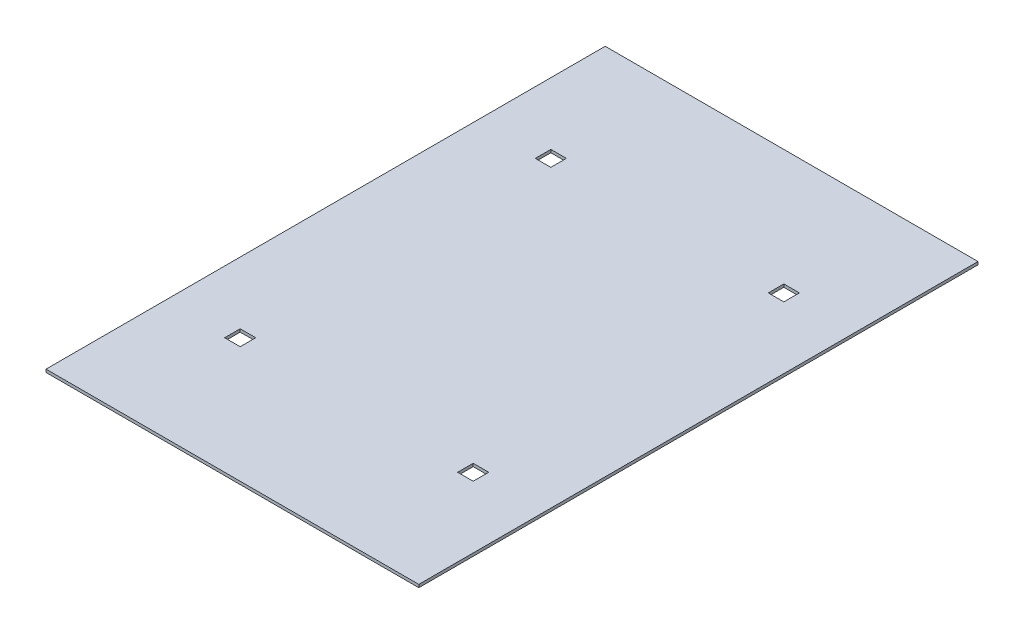
ISO-10303-21;
HEADER;
FILE_DESCRIPTION(('STEP AP214'),'2;1');
FILE_NAME('part.step','',(''),(''),'','','');
FILE_SCHEMA(('AUTOMOTIVE_DESIGN { 1 0 10303 214 1 1 1 1 }'));
ENDSEC;
DATA;
#1=APPLICATION_CONTEXT('core data for automotive mechanical design processes');
#2=APPLICATION_PROTOCOL_DEFINITION('international standard','automotive_design',2000,#1);
#3=PRODUCT_CONTEXT('',#1,'mechanical');
#4=PRODUCT('Part','Part','',(#3));
#5=PRODUCT_RELATED_PRODUCT_CATEGORY('part','',(#4));
#6=PRODUCT_DEFINITION_FORMATION('','',#4);
#7=PRODUCT_DEFINITION_CONTEXT('part definition',#1,'design');
#8=PRODUCT_DEFINITION('design','',#6,#7);
#9=PRODUCT_DEFINITION_SHAPE('','',#8);
#10=(LENGTH_UNIT() NAMED_UNIT(*) SI_UNIT(.MILLI.,.METRE.));
#11=(NAMED_UNIT(*) PLANE_ANGLE_UNIT() SI_UNIT($,.RADIAN.));
#12=(NAMED_UNIT(*) SI_UNIT($,.STERADIAN.) SOLID_ANGLE_UNIT());
#13=UNCERTAINTY_MEASURE_WITH_UNIT(LENGTH_MEASURE(1.E-05),#10,'distance_accuracy_value','');
#14=(GEOMETRIC_REPRESENTATION_CONTEXT(3) GLOBAL_UNCERTAINTY_ASSIGNED_CONTEXT((#13)) GLOBAL_UNIT_ASSIGNED_CONTEXT((#10,
#11,#12)) REPRESENTATION_CONTEXT('',''));
#15=CARTESIAN_POINT('',(0.,0.,0.));
#16=DIRECTION('',(0.,0.,1.));
#17=DIRECTION('',(1.,0.,0.));
#18=AXIS2_PLACEMENT_3D('',#15,#16,#17);
#19=CARTESIAN_POINT('',(0.,4.7625,0.));
#20=DIRECTION('',(1.,0.,0.));
#21=DIRECTION('',(0.,0.,-1.));
#22=AXIS2_PLACEMENT_3D('',#19,#20,#21);
#23=PLANE('',#22);
#24=DIRECTION('',(0.,0.,1.));
#25=VECTOR('',#24,1.);
#26=CARTESIAN_POINT('',(0.,0.,0.));
#27=LINE('',#26,#25);
#28=CARTESIAN_POINT('',(0.,0.,-914.4));
#29=VERTEX_POINT('',#28);
#30=CARTESIAN_POINT('',(0.,0.,0.));
#31=VERTEX_POINT('',#30);
#32=EDGE_CURVE('E298',#29,#31,#27,.T.);
#33=ORIENTED_EDGE('',*,*,#32,.T.);
#34=DIRECTION('',(0.,-1.,0.));
#35=VECTOR('',#34,1.);
#36=CARTESIAN_POINT('',(0.,4.7625,0.));
#37=LINE('',#36,#35);
#38=CARTESIAN_POINT('',(0.,4.7625,0.));
#39=VERTEX_POINT('',#38);
#40=EDGE_CURVE('E11',#39,#31,#37,.T.);
#41=ORIENTED_EDGE('',*,*,#40,.F.);
#42=DIRECTION('',(0.,0.,1.));
#43=VECTOR('',#42,1.);
#44=CARTESIAN_POINT('',(0.,4.7625,0.));
#45=LINE('',#44,#43);
#46=CARTESIAN_POINT('',(0.,4.7625,-914.4));
#47=VERTEX_POINT('',#46);
#48=EDGE_CURVE('E305',#47,#39,#45,.T.);
#49=ORIENTED_EDGE('',*,*,#48,.F.);
#50=DIRECTION('',(0.,-1.,0.));
#51=VECTOR('',#50,1.);
#52=CARTESIAN_POINT('',(0.,4.7625,-914.4));
#53=LINE('',#52,#51);
#54=EDGE_CURVE('E315',#47,#29,#53,.T.);
#55=ORIENTED_EDGE('',*,*,#54,.T.);
#56=EDGE_LOOP('',(#33,#41,#49,#55));
#57=FACE_BOUND('',#56,.T.);
#58=ADVANCED_FACE('F33',(#57),#23,.F.);
#59=CARTESIAN_POINT('',(0.,4.7625,0.));
#60=DIRECTION('',(0.,0.,-1.));
#61=DIRECTION('',(-1.,0.,0.));
#62=AXIS2_PLACEMENT_3D('',#59,#60,#61);
#63=PLANE('',#62);
#64=DIRECTION('',(1.,0.,0.));
#65=VECTOR('',#64,1.);
#66=CARTESIAN_POINT('',(0.,0.,0.));
#67=LINE('',#66,#65);
#68=CARTESIAN_POINT('',(609.6,0.,0.));
#69=VERTEX_POINT('',#68);
#70=EDGE_CURVE('E318',#31,#69,#67,.T.);
#71=ORIENTED_EDGE('',*,*,#70,.T.);
#72=DIRECTION('',(0.,-1.,0.));
#73=VECTOR('',#72,1.);
#74=CARTESIAN_POINT('',(609.6,4.7625,0.));
#75=LINE('',#74,#73);
#76=CARTESIAN_POINT('',(609.6,4.7625,0.));
#77=VERTEX_POINT('',#76);
#78=EDGE_CURVE('E40',#77,#69,#75,.T.);
#79=ORIENTED_EDGE('',*,*,#78,.F.);
#80=DIRECTION('',(1.,0.,0.));
#81=VECTOR('',#80,1.);
#82=CARTESIAN_POINT('',(0.,4.7625,0.));
#83=LINE('',#82,#81);
#84=EDGE_CURVE('E308',#39,#77,#83,.T.);
#85=ORIENTED_EDGE('',*,*,#84,.F.);
#86=ORIENTED_EDGE('',*,*,#40,.T.);
#87=EDGE_LOOP('',(#71,#79,#85,#86));
#88=FACE_BOUND('',#87,.T.);
#89=ADVANCED_FACE('F347',(#88),#63,.F.);
#90=CARTESIAN_POINT('',(609.6,4.7625,0.));
#91=DIRECTION('',(-1.,0.,0.));
#92=DIRECTION('',(0.,0.,1.));
#93=AXIS2_PLACEMENT_3D('',#90,#91,#92);
#94=PLANE('',#93);
#95=DIRECTION('',(0.,0.,-1.));
#96=VECTOR('',#95,1.);
#97=CARTESIAN_POINT('',(609.6,0.,0.));
#98=LINE('',#97,#96);
#99=CARTESIAN_POINT('',(609.6,0.,-914.4));
#100=VERTEX_POINT('',#99);
#101=EDGE_CURVE('E320',#69,#100,#98,.T.);
#102=ORIENTED_EDGE('',*,*,#101,.T.);
#103=DIRECTION('',(0.,-1.,0.));
#104=VECTOR('',#103,1.);
#105=CARTESIAN_POINT('',(609.6,4.7625,-914.4));
#106=LINE('',#105,#104);
#107=CARTESIAN_POINT('',(609.6,4.7625,-914.4));
#108=VERTEX_POINT('',#107);
#109=EDGE_CURVE('E325',#108,#100,#106,.T.);
#110=ORIENTED_EDGE('',*,*,#109,.F.);
#111=DIRECTION('',(0.,0.,-1.));
#112=VECTOR('',#111,1.);
#113=CARTESIAN_POINT('',(609.6,4.7625,0.));
#114=LINE('',#113,#112);
#115=EDGE_CURVE('E311',#77,#108,#114,.T.);
#116=ORIENTED_EDGE('',*,*,#115,.F.);
#117=ORIENTED_EDGE('',*,*,#78,.T.);
#118=EDGE_LOOP('',(#102,#110,#116,#117));
#119=FACE_BOUND('',#118,.T.);
#120=ADVANCED_FACE('F332',(#119),#94,.F.);
#121=CARTESIAN_POINT('',(0.,4.7625,-914.4));
#122=DIRECTION('',(0.,0.,1.));
#123=DIRECTION('',(1.,0.,0.));
#124=AXIS2_PLACEMENT_3D('',#121,#122,#123);
#125=PLANE('',#124);
#126=DIRECTION('',(-1.,0.,0.));
#127=VECTOR('',#126,1.);
#128=CARTESIAN_POINT('',(0.,0.,-914.4));
#129=LINE('',#128,#127);
#130=EDGE_CURVE('E309',#100,#29,#129,.T.);
#131=ORIENTED_EDGE('',*,*,#130,.T.);
#132=ORIENTED_EDGE('',*,*,#54,.F.);
#133=DIRECTION('',(-1.,0.,0.));
#134=VECTOR('',#133,1.);
#135=CARTESIAN_POINT('',(0.,4.7625,-914.4));
#136=LINE('',#135,#134);
#137=EDGE_CURVE('E313',#108,#47,#136,.T.);
#138=ORIENTED_EDGE('',*,*,#137,.F.);
#139=ORIENTED_EDGE('',*,*,#109,.T.);
#140=EDGE_LOOP('',(#131,#132,#138,#139));
#141=FACE_BOUND('',#140,.T.);
#142=ADVANCED_FACE('F340',(#141),#125,.F.);
#143=CARTESIAN_POINT('',(0.,4.7625,0.));
#144=DIRECTION('',(0.,-1.,0.));
#145=DIRECTION('',(0.,0.,-1.));
#146=AXIS2_PLACEMENT_3D('',#143,#144,#145);
#147=PLANE('',#146);
#148=DIRECTION('',(1.,0.,0.));
#149=VECTOR('',#148,1.);
#150=CARTESIAN_POINT('',(482.6,4.7625,-698.5));
#151=LINE('',#150,#149);
#152=CARTESIAN_POINT('',(482.6,4.7625,-698.5));
#153=VERTEX_POINT('',#152);
#154=CARTESIAN_POINT('',(508.,4.7625,-698.5));
#155=VERTEX_POINT('',#154);
#156=EDGE_CURVE('E227',#153,#155,#151,.T.);
#157=ORIENTED_EDGE('',*,*,#156,.F.);
#158=DIRECTION('',(0.,0.,1.));
#159=VECTOR('',#158,1.);
#160=CARTESIAN_POINT('',(482.6,4.7625,-723.9));
#161=LINE('',#160,#159);
#162=CARTESIAN_POINT('',(482.6,4.7625,-723.9));
#163=VERTEX_POINT('',#162);
#164=EDGE_CURVE('E47',#163,#153,#161,.T.);
#165=ORIENTED_EDGE('',*,*,#164,.F.);
#166=DIRECTION('',(-1.,0.,0.));
#167=VECTOR('',#166,1.);
#168=CARTESIAN_POINT('',(482.6,4.7625,-723.9));
#169=LINE('',#168,#167);
#170=CARTESIAN_POINT('',(508.,4.7625,-723.9));
#171=VERTEX_POINT('',#170);
#172=EDGE_CURVE('E216',#171,#163,#169,.T.);
#173=ORIENTED_EDGE('',*,*,#172,.F.);
#174=DIRECTION('',(0.,0.,-1.));
#175=VECTOR('',#174,1.);
#176=CARTESIAN_POINT('',(508.,4.7625,-723.9));
#177=LINE('',#176,#175);
#178=EDGE_CURVE('E231',#155,#171,#177,.T.);
#179=ORIENTED_EDGE('',*,*,#178,.F.);
#180=EDGE_LOOP('',(#157,#165,#173,#179));
#181=FACE_BOUND('',#180,.T.);
#182=DIRECTION('',(1.,0.,0.));
#183=VECTOR('',#182,1.);
#184=CARTESIAN_POINT('',(101.6,4.7625,-190.5));
#185=LINE('',#184,#183);
#186=CARTESIAN_POINT('',(101.6,4.7625,-190.5));
#187=VERTEX_POINT('',#186);
#188=CARTESIAN_POINT('',(127.,4.7625,-190.5));
#189=VERTEX_POINT('',#188);
#190=EDGE_CURVE('E259',#187,#189,#185,.T.);
#191=ORIENTED_EDGE('',*,*,#190,.F.);
#192=DIRECTION('',(0.,0.,1.));
#193=VECTOR('',#192,1.);
#194=CARTESIAN_POINT('',(101.6,4.7625,-215.9));
#195=LINE('',#194,#193);
#196=CARTESIAN_POINT('',(101.6,4.7625,-215.9));
#197=VERTEX_POINT('',#196);
#198=EDGE_CURVE('E55',#197,#187,#195,.T.);
#199=ORIENTED_EDGE('',*,*,#198,.F.);
#200=DIRECTION('',(-1.,0.,0.));
#201=VECTOR('',#200,1.);
#202=CARTESIAN_POINT('',(101.6,4.7625,-215.9));
#203=LINE('',#202,#201);
#204=CARTESIAN_POINT('',(127.,4.7625,-215.9));
#205=VERTEX_POINT('',#204);
#206=EDGE_CURVE('E248',#205,#197,#203,.T.);
#207=ORIENTED_EDGE('',*,*,#206,.F.);
#208=DIRECTION('',(0.,0.,-1.));
#209=VECTOR('',#208,1.);
#210=CARTESIAN_POINT('',(127.,4.7625,-215.9));
#211=LINE('',#210,#209);
#212=EDGE_CURVE('E262',#189,#205,#211,.T.);
#213=ORIENTED_EDGE('',*,*,#212,.F.);
#214=EDGE_LOOP('',(#191,#199,#207,#213));
#215=FACE_BOUND('',#214,.T.);
#216=DIRECTION('',(-1.,0.,0.));
#217=VECTOR('',#216,1.);
#218=CARTESIAN_POINT('',(508.,4.7625,-215.9));
#219=LINE('',#218,#217);
#220=CARTESIAN_POINT('',(508.,4.7625,-215.9));
#221=VERTEX_POINT('',#220);
#222=CARTESIAN_POINT('',(482.6,4.7625,-215.9));
#223=VERTEX_POINT('',#222);
#224=EDGE_CURVE('E203',#221,#223,#219,.T.);
#225=ORIENTED_EDGE('',*,*,#224,.F.);
#226=DIRECTION('',(0.,0.,-1.));
#227=VECTOR('',#226,1.);
#228=CARTESIAN_POINT('',(508.,4.7625,-190.5));
#229=LINE('',#228,#227);
#230=CARTESIAN_POINT('',(508.,4.7625,-190.5));
#231=VERTEX_POINT('',#230);
#232=EDGE_CURVE('E176',#231,#221,#229,.T.);
#233=ORIENTED_EDGE('',*,*,#232,.F.);
#234=DIRECTION('',(1.,0.,0.));
#235=VECTOR('',#234,1.);
#236=CARTESIAN_POINT('',(508.,4.7625,-190.5));
#237=LINE('',#236,#235);
#238=CARTESIAN_POINT('',(482.6,4.7625,-190.5));
#239=VERTEX_POINT('',#238);
#240=EDGE_CURVE('E194',#239,#231,#237,.T.);
#241=ORIENTED_EDGE('',*,*,#240,.F.);
#242=DIRECTION('',(0.,0.,1.));
#243=VECTOR('',#242,1.);
#244=CARTESIAN_POINT('',(482.6,4.7625,-190.5));
#245=LINE('',#244,#243);
#246=EDGE_CURVE('E197',#223,#239,#245,.T.);
#247=ORIENTED_EDGE('',*,*,#246,.F.);
#248=EDGE_LOOP('',(#225,#233,#241,#247));
#249=FACE_BOUND('',#248,.T.);
#250=DIRECTION('',(1.,0.,0.));
#251=VECTOR('',#250,1.);
#252=CARTESIAN_POINT('',(101.6,4.7625,-698.5));
#253=LINE('',#252,#251);
#254=CARTESIAN_POINT('',(101.6,4.7625,-698.5));
#255=VERTEX_POINT('',#254);
#256=CARTESIAN_POINT('',(127.,4.7625,-698.5));
#257=VERTEX_POINT('',#256);
#258=EDGE_CURVE('E288',#255,#257,#253,.T.);
#259=ORIENTED_EDGE('',*,*,#258,.F.);
#260=DIRECTION('',(0.,0.,1.));
#261=VECTOR('',#260,1.);
#262=CARTESIAN_POINT('',(101.6,4.7625,-723.9));
#263=LINE('',#262,#261);
#264=CARTESIAN_POINT('',(101.6,4.7625,-723.9));
#265=VERTEX_POINT('',#264);
#266=EDGE_CURVE('E238',#265,#255,#263,.T.);
#267=ORIENTED_EDGE('',*,*,#266,.F.);
#268=DIRECTION('',(-1.,0.,0.));
#269=VECTOR('',#268,1.);
#270=CARTESIAN_POINT('',(101.6,4.7625,-723.9));
#271=LINE('',#270,#269);
#272=CARTESIAN_POINT('',(127.,4.7625,-723.9));
#273=VERTEX_POINT('',#272);
#274=EDGE_CURVE('E277',#273,#265,#271,.T.);
#275=ORIENTED_EDGE('',*,*,#274,.F.);
#276=DIRECTION('',(0.,0.,-1.));
#277=VECTOR('',#276,1.);
#278=CARTESIAN_POINT('',(127.,4.7625,-723.9));
#279=LINE('',#278,#277);
#280=EDGE_CURVE('E291',#257,#273,#279,.T.);
#281=ORIENTED_EDGE('',*,*,#280,.F.);
#282=EDGE_LOOP('',(#259,#267,#275,#281));
#283=FACE_BOUND('',#282,.T.);
#284=ORIENTED_EDGE('',*,*,#48,.T.);
#285=ORIENTED_EDGE('',*,*,#84,.T.);
#286=ORIENTED_EDGE('',*,*,#115,.T.);
#287=ORIENTED_EDGE('',*,*,#137,.T.);
#288=EDGE_LOOP('',(#284,#285,#286,#287));
#289=FACE_BOUND('',#288,.T.);
#290=ADVANCED_FACE('F346',(#181,#215,#249,#283,#289),#147,.F.);
#291=CARTESIAN_POINT('',(0.,0.,0.));
#292=DIRECTION('',(0.,-1.,0.));
#293=DIRECTION('',(0.,0.,-1.));
#294=AXIS2_PLACEMENT_3D('',#291,#292,#293);
#295=PLANE('',#294);
#296=DIRECTION('',(0.,0.,1.));
#297=VECTOR('',#296,1.);
#298=CARTESIAN_POINT('',(482.6,0.,-723.9));
#299=LINE('',#298,#297);
#300=CARTESIAN_POINT('',(482.6,0.,-723.9));
#301=VERTEX_POINT('',#300);
#302=CARTESIAN_POINT('',(482.6,0.,-698.5));
#303=VERTEX_POINT('',#302);
#304=EDGE_CURVE('E212',#301,#303,#299,.T.);
#305=ORIENTED_EDGE('',*,*,#304,.T.);
#306=DIRECTION('',(1.,0.,0.));
#307=VECTOR('',#306,1.);
#308=CARTESIAN_POINT('',(482.6,0.,-698.5));
#309=LINE('',#308,#307);
#310=CARTESIAN_POINT('',(508.,0.,-698.5));
#311=VERTEX_POINT('',#310);
#312=EDGE_CURVE('E215',#303,#311,#309,.T.);
#313=ORIENTED_EDGE('',*,*,#312,.T.);
#314=DIRECTION('',(0.,0.,-1.));
#315=VECTOR('',#314,1.);
#316=CARTESIAN_POINT('',(508.,0.,-723.9));
#317=LINE('',#316,#315);
#318=CARTESIAN_POINT('',(508.,0.,-723.9));
#319=VERTEX_POINT('',#318);
#320=EDGE_CURVE('E219',#311,#319,#317,.T.);
#321=ORIENTED_EDGE('',*,*,#320,.T.);
#322=DIRECTION('',(-1.,0.,0.));
#323=VECTOR('',#322,1.);
#324=CARTESIAN_POINT('',(482.6,0.,-723.9));
#325=LINE('',#324,#323);
#326=EDGE_CURVE('E222',#319,#301,#325,.T.);
#327=ORIENTED_EDGE('',*,*,#326,.T.);
#328=EDGE_LOOP('',(#305,#313,#321,#327));
#329=FACE_BOUND('',#328,.T.);
#330=DIRECTION('',(0.,0.,1.));
#331=VECTOR('',#330,1.);
#332=CARTESIAN_POINT('',(101.6,0.,-215.9));
#333=LINE('',#332,#331);
#334=CARTESIAN_POINT('',(101.6,0.,-215.9));
#335=VERTEX_POINT('',#334);
#336=CARTESIAN_POINT('',(101.6,0.,-190.5));
#337=VERTEX_POINT('',#336);
#338=EDGE_CURVE('E244',#335,#337,#333,.T.);
#339=ORIENTED_EDGE('',*,*,#338,.T.);
#340=DIRECTION('',(1.,0.,0.));
#341=VECTOR('',#340,1.);
#342=CARTESIAN_POINT('',(101.6,0.,-190.5));
#343=LINE('',#342,#341);
#344=CARTESIAN_POINT('',(127.,0.,-190.5));
#345=VERTEX_POINT('',#344);
#346=EDGE_CURVE('E247',#337,#345,#343,.T.);
#347=ORIENTED_EDGE('',*,*,#346,.T.);
#348=DIRECTION('',(0.,0.,-1.));
#349=VECTOR('',#348,1.);
#350=CARTESIAN_POINT('',(127.,0.,-215.9));
#351=LINE('',#350,#349);
#352=CARTESIAN_POINT('',(127.,0.,-215.9));
#353=VERTEX_POINT('',#352);
#354=EDGE_CURVE('E251',#345,#353,#351,.T.);
#355=ORIENTED_EDGE('',*,*,#354,.T.);
#356=DIRECTION('',(-1.,0.,0.));
#357=VECTOR('',#356,1.);
#358=CARTESIAN_POINT('',(101.6,0.,-215.9));
#359=LINE('',#358,#357);
#360=EDGE_CURVE('E254',#353,#335,#359,.T.);
#361=ORIENTED_EDGE('',*,*,#360,.T.);
#362=EDGE_LOOP('',(#339,#347,#355,#361));
#363=FACE_BOUND('',#362,.T.);
#364=DIRECTION('',(0.,0.,-1.));
#365=VECTOR('',#364,1.);
#366=CARTESIAN_POINT('',(508.,0.,-190.5));
#367=LINE('',#366,#365);
#368=CARTESIAN_POINT('',(508.,0.,-190.5));
#369=VERTEX_POINT('',#368);
#370=CARTESIAN_POINT('',(508.,0.,-215.9));
#371=VERTEX_POINT('',#370);
#372=EDGE_CURVE('E173',#369,#371,#367,.T.);
#373=ORIENTED_EDGE('',*,*,#372,.T.);
#374=DIRECTION('',(-1.,0.,0.));
#375=VECTOR('',#374,1.);
#376=CARTESIAN_POINT('',(508.,0.,-215.9));
#377=LINE('',#376,#375);
#378=CARTESIAN_POINT('',(482.6,0.,-215.9));
#379=VERTEX_POINT('',#378);
#380=EDGE_CURVE('E185',#371,#379,#377,.T.);
#381=ORIENTED_EDGE('',*,*,#380,.T.);
#382=DIRECTION('',(0.,0.,1.));
#383=VECTOR('',#382,1.);
#384=CARTESIAN_POINT('',(482.6,0.,-190.5));
#385=LINE('',#384,#383);
#386=CARTESIAN_POINT('',(482.6,0.,-190.5));
#387=VERTEX_POINT('',#386);
#388=EDGE_CURVE('E189',#379,#387,#385,.T.);
#389=ORIENTED_EDGE('',*,*,#388,.T.);
#390=DIRECTION('',(1.,0.,0.));
#391=VECTOR('',#390,1.);
#392=CARTESIAN_POINT('',(508.,0.,-190.5));
#393=LINE('',#392,#391);
#394=EDGE_CURVE('E181',#387,#369,#393,.T.);
#395=ORIENTED_EDGE('',*,*,#394,.T.);
#396=EDGE_LOOP('',(#373,#381,#389,#395));
#397=FACE_BOUND('',#396,.T.);
#398=DIRECTION('',(0.,0.,1.));
#399=VECTOR('',#398,1.);
#400=CARTESIAN_POINT('',(101.6,0.,-723.9));
#401=LINE('',#400,#399);
#402=CARTESIAN_POINT('',(101.6,0.,-723.9));
#403=VERTEX_POINT('',#402);
#404=CARTESIAN_POINT('',(101.6,0.,-698.5));
#405=VERTEX_POINT('',#404);
#406=EDGE_CURVE('E273',#403,#405,#401,.T.);
#407=ORIENTED_EDGE('',*,*,#406,.T.);
#408=DIRECTION('',(1.,0.,0.));
#409=VECTOR('',#408,1.);
#410=CARTESIAN_POINT('',(101.6,0.,-698.5));
#411=LINE('',#410,#409);
#412=CARTESIAN_POINT('',(127.,0.,-698.5));
#413=VERTEX_POINT('',#412);
#414=EDGE_CURVE('E276',#405,#413,#411,.T.);
#415=ORIENTED_EDGE('',*,*,#414,.T.);
#416=DIRECTION('',(0.,0.,-1.));
#417=VECTOR('',#416,1.);
#418=CARTESIAN_POINT('',(127.,0.,-723.9));
#419=LINE('',#418,#417);
#420=CARTESIAN_POINT('',(127.,0.,-723.9));
#421=VERTEX_POINT('',#420);
#422=EDGE_CURVE('E280',#413,#421,#419,.T.);
#423=ORIENTED_EDGE('',*,*,#422,.T.);
#424=DIRECTION('',(-1.,0.,0.));
#425=VECTOR('',#424,1.);
#426=CARTESIAN_POINT('',(101.6,0.,-723.9));
#427=LINE('',#426,#425);
#428=EDGE_CURVE('E283',#421,#403,#427,.T.);
#429=ORIENTED_EDGE('',*,*,#428,.T.);
#430=EDGE_LOOP('',(#407,#415,#423,#429));
#431=FACE_BOUND('',#430,.T.);
#432=ORIENTED_EDGE('',*,*,#32,.F.);
#433=ORIENTED_EDGE('',*,*,#130,.F.);
#434=ORIENTED_EDGE('',*,*,#101,.F.);
#435=ORIENTED_EDGE('',*,*,#70,.F.);
#436=EDGE_LOOP('',(#432,#433,#434,#435));
#437=FACE_BOUND('',#436,.T.);
#438=ADVANCED_FACE('F191',(#329,#363,#397,#431,#437),#295,.T.);
#439=CARTESIAN_POINT('',(101.6,0.,-723.9));
#440=DIRECTION('',(-1.,0.,0.));
#441=DIRECTION('',(0.,0.,1.));
#442=AXIS2_PLACEMENT_3D('',#439,#440,#441);
#443=PLANE('',#442);
#444=ORIENTED_EDGE('',*,*,#266,.T.);
#445=DIRECTION('',(0.,1.,0.));
#446=VECTOR('',#445,1.);
#447=CARTESIAN_POINT('',(101.6,0.,-698.5));
#448=LINE('',#447,#446);
#449=EDGE_CURVE('E286',#405,#255,#448,.T.);
#450=ORIENTED_EDGE('',*,*,#449,.F.);
#451=ORIENTED_EDGE('',*,*,#406,.F.);
#452=DIRECTION('',(0.,1.,0.));
#453=VECTOR('',#452,1.);
#454=CARTESIAN_POINT('',(101.6,0.,-723.9));
#455=LINE('',#454,#453);
#456=EDGE_CURVE('E296',#403,#265,#455,.T.);
#457=ORIENTED_EDGE('',*,*,#456,.T.);
#458=EDGE_LOOP('',(#444,#450,#451,#457));
#459=FACE_BOUND('',#458,.T.);
#460=ADVANCED_FACE('F359',(#459),#443,.F.);
#461=CARTESIAN_POINT('',(101.6,0.,-723.9));
#462=DIRECTION('',(0.,0.,-1.));
#463=DIRECTION('',(-1.,0.,0.));
#464=AXIS2_PLACEMENT_3D('',#461,#462,#463);
#465=PLANE('',#464);
#466=ORIENTED_EDGE('',*,*,#274,.T.);
#467=ORIENTED_EDGE('',*,*,#456,.F.);
#468=ORIENTED_EDGE('',*,*,#428,.F.);
#469=DIRECTION('',(0.,1.,0.));
#470=VECTOR('',#469,1.);
#471=CARTESIAN_POINT('',(127.,0.,-723.9));
#472=LINE('',#471,#470);
#473=EDGE_CURVE('E299',#421,#273,#472,.T.);
#474=ORIENTED_EDGE('',*,*,#473,.T.);
#475=EDGE_LOOP('',(#466,#467,#468,#474));
#476=FACE_BOUND('',#475,.T.);
#477=ADVANCED_FACE('F366',(#476),#465,.F.);
#478=CARTESIAN_POINT('',(127.,0.,-723.9));
#479=DIRECTION('',(1.,0.,0.));
#480=DIRECTION('',(0.,0.,-1.));
#481=AXIS2_PLACEMENT_3D('',#478,#479,#480);
#482=PLANE('',#481);
#483=ORIENTED_EDGE('',*,*,#280,.T.);
#484=ORIENTED_EDGE('',*,*,#473,.F.);
#485=ORIENTED_EDGE('',*,*,#422,.F.);
#486=DIRECTION('',(0.,1.,0.));
#487=VECTOR('',#486,1.);
#488=CARTESIAN_POINT('',(127.,0.,-698.5));
#489=LINE('',#488,#487);
#490=EDGE_CURVE('E301',#413,#257,#489,.T.);
#491=ORIENTED_EDGE('',*,*,#490,.T.);
#492=EDGE_LOOP('',(#483,#484,#485,#491));
#493=FACE_BOUND('',#492,.T.);
#494=ADVANCED_FACE('F371',(#493),#482,.F.);
#495=CARTESIAN_POINT('',(101.6,0.,-698.5));
#496=DIRECTION('',(0.,0.,1.));
#497=DIRECTION('',(1.,0.,0.));
#498=AXIS2_PLACEMENT_3D('',#495,#496,#497);
#499=PLANE('',#498);
#500=ORIENTED_EDGE('',*,*,#258,.T.);
#501=ORIENTED_EDGE('',*,*,#490,.F.);
#502=ORIENTED_EDGE('',*,*,#414,.F.);
#503=ORIENTED_EDGE('',*,*,#449,.T.);
#504=EDGE_LOOP('',(#500,#501,#502,#503));
#505=FACE_BOUND('',#504,.T.);
#506=ADVANCED_FACE('F368',(#505),#499,.F.);
#507=CARTESIAN_POINT('',(508.,0.,-190.5));
#508=DIRECTION('',(1.,0.,0.));
#509=DIRECTION('',(0.,0.,-1.));
#510=AXIS2_PLACEMENT_3D('',#507,#508,#509);
#511=PLANE('',#510);
#512=ORIENTED_EDGE('',*,*,#232,.T.);
#513=DIRECTION('',(0.,1.,0.));
#514=VECTOR('',#513,1.);
#515=CARTESIAN_POINT('',(508.,0.,-215.9));
#516=LINE('',#515,#514);
#517=EDGE_CURVE('E169',#371,#221,#516,.T.);
#518=ORIENTED_EDGE('',*,*,#517,.F.);
#519=ORIENTED_EDGE('',*,*,#372,.F.);
#520=DIRECTION('',(0.,1.,0.));
#521=VECTOR('',#520,1.);
#522=CARTESIAN_POINT('',(508.,0.,-190.5));
#523=LINE('',#522,#521);
#524=EDGE_CURVE('E207',#369,#231,#523,.T.);
#525=ORIENTED_EDGE('',*,*,#524,.T.);
#526=EDGE_LOOP('',(#512,#518,#519,#525));
#527=FACE_BOUND('',#526,.T.);
#528=ADVANCED_FACE('F171',(#527),#511,.F.);
#529=CARTESIAN_POINT('',(508.,0.,-190.5));
#530=DIRECTION('',(0.,0.,1.));
#531=DIRECTION('',(1.,0.,0.));
#532=AXIS2_PLACEMENT_3D('',#529,#530,#531);
#533=PLANE('',#532);
#534=ORIENTED_EDGE('',*,*,#240,.T.);
#535=ORIENTED_EDGE('',*,*,#524,.F.);
#536=ORIENTED_EDGE('',*,*,#394,.F.);
#537=DIRECTION('',(0.,1.,0.));
#538=VECTOR('',#537,1.);
#539=CARTESIAN_POINT('',(482.6,0.,-190.5));
#540=LINE('',#539,#538);
#541=EDGE_CURVE('E209',#387,#239,#540,.T.);
#542=ORIENTED_EDGE('',*,*,#541,.T.);
#543=EDGE_LOOP('',(#534,#535,#536,#542));
#544=FACE_BOUND('',#543,.T.);
#545=ADVANCED_FACE('F411',(#544),#533,.F.);
#546=CARTESIAN_POINT('',(482.6,0.,-190.5));
#547=DIRECTION('',(-1.,0.,0.));
#548=DIRECTION('',(0.,0.,1.));
#549=AXIS2_PLACEMENT_3D('',#546,#547,#548);
#550=PLANE('',#549);
#551=ORIENTED_EDGE('',*,*,#246,.T.);
#552=ORIENTED_EDGE('',*,*,#541,.F.);
#553=ORIENTED_EDGE('',*,*,#388,.F.);
#554=DIRECTION('',(0.,1.,0.));
#555=VECTOR('',#554,1.);
#556=CARTESIAN_POINT('',(482.6,0.,-215.9));
#557=LINE('',#556,#555);
#558=EDGE_CURVE('E180',#379,#223,#557,.T.);
#559=ORIENTED_EDGE('',*,*,#558,.T.);
#560=EDGE_LOOP('',(#551,#552,#553,#559));
#561=FACE_BOUND('',#560,.T.);
#562=ADVANCED_FACE('F414',(#561),#550,.F.);
#563=CARTESIAN_POINT('',(508.,0.,-215.9));
#564=DIRECTION('',(0.,0.,-1.));
#565=DIRECTION('',(-1.,0.,0.));
#566=AXIS2_PLACEMENT_3D('',#563,#564,#565);
#567=PLANE('',#566);
#568=ORIENTED_EDGE('',*,*,#224,.T.);
#569=ORIENTED_EDGE('',*,*,#558,.F.);
#570=ORIENTED_EDGE('',*,*,#380,.F.);
#571=ORIENTED_EDGE('',*,*,#517,.T.);
#572=EDGE_LOOP('',(#568,#569,#570,#571));
#573=FACE_BOUND('',#572,.T.);
#574=ADVANCED_FACE('F186',(#573),#567,.F.);
#575=CARTESIAN_POINT('',(101.6,0.,-215.9));
#576=DIRECTION('',(-1.,0.,0.));
#577=DIRECTION('',(0.,0.,1.));
#578=AXIS2_PLACEMENT_3D('',#575,#576,#577);
#579=PLANE('',#578);
#580=ORIENTED_EDGE('',*,*,#198,.T.);
#581=DIRECTION('',(0.,1.,0.));
#582=VECTOR('',#581,1.);
#583=CARTESIAN_POINT('',(101.6,0.,-190.5));
#584=LINE('',#583,#582);
#585=EDGE_CURVE('E257',#337,#187,#584,.T.);
#586=ORIENTED_EDGE('',*,*,#585,.F.);
#587=ORIENTED_EDGE('',*,*,#338,.F.);
#588=DIRECTION('',(0.,1.,0.));
#589=VECTOR('',#588,1.);
#590=CARTESIAN_POINT('',(101.6,0.,-215.9));
#591=LINE('',#590,#589);
#592=EDGE_CURVE('E228',#335,#197,#591,.T.);
#593=ORIENTED_EDGE('',*,*,#592,.T.);
#594=EDGE_LOOP('',(#580,#586,#587,#593));
#595=FACE_BOUND('',#594,.T.);
#596=ADVANCED_FACE('F379',(#595),#579,.F.);
#597=CARTESIAN_POINT('',(101.6,0.,-215.9));
#598=DIRECTION('',(0.,0.,-1.));
#599=DIRECTION('',(-1.,0.,0.));
#600=AXIS2_PLACEMENT_3D('',#597,#598,#599);
#601=PLANE('',#600);
#602=ORIENTED_EDGE('',*,*,#206,.T.);
#603=ORIENTED_EDGE('',*,*,#592,.F.);
#604=ORIENTED_EDGE('',*,*,#360,.F.);
#605=DIRECTION('',(0.,1.,0.));
#606=VECTOR('',#605,1.);
#607=CARTESIAN_POINT('',(127.,0.,-215.9));
#608=LINE('',#607,#606);
#609=EDGE_CURVE('E268',#353,#205,#608,.T.);
#610=ORIENTED_EDGE('',*,*,#609,.T.);
#611=EDGE_LOOP('',(#602,#603,#604,#610));
#612=FACE_BOUND('',#611,.T.);
#613=ADVANCED_FACE('F382',(#612),#601,.F.);
#614=CARTESIAN_POINT('',(127.,0.,-215.9));
#615=DIRECTION('',(1.,0.,0.));
#616=DIRECTION('',(0.,0.,-1.));
#617=AXIS2_PLACEMENT_3D('',#614,#615,#616);
#618=PLANE('',#617);
#619=ORIENTED_EDGE('',*,*,#212,.T.);
#620=ORIENTED_EDGE('',*,*,#609,.F.);
#621=ORIENTED_EDGE('',*,*,#354,.F.);
#622=DIRECTION('',(0.,1.,0.));
#623=VECTOR('',#622,1.);
#624=CARTESIAN_POINT('',(127.,0.,-190.5));
#625=LINE('',#624,#623);
#626=EDGE_CURVE('E270',#345,#189,#625,.T.);
#627=ORIENTED_EDGE('',*,*,#626,.T.);
#628=EDGE_LOOP('',(#619,#620,#621,#627));
#629=FACE_BOUND('',#628,.T.);
#630=ADVANCED_FACE('F387',(#629),#618,.F.);
#631=CARTESIAN_POINT('',(101.6,0.,-190.5));
#632=DIRECTION('',(0.,0.,1.));
#633=DIRECTION('',(1.,0.,0.));
#634=AXIS2_PLACEMENT_3D('',#631,#632,#633);
#635=PLANE('',#634);
#636=ORIENTED_EDGE('',*,*,#190,.T.);
#637=ORIENTED_EDGE('',*,*,#626,.F.);
#638=ORIENTED_EDGE('',*,*,#346,.F.);
#639=ORIENTED_EDGE('',*,*,#585,.T.);
#640=EDGE_LOOP('',(#636,#637,#638,#639));
#641=FACE_BOUND('',#640,.T.);
#642=ADVANCED_FACE('F383',(#641),#635,.F.);
#643=CARTESIAN_POINT('',(482.6,0.,-723.9));
#644=DIRECTION('',(-1.,0.,0.));
#645=DIRECTION('',(0.,0.,1.));
#646=AXIS2_PLACEMENT_3D('',#643,#644,#645);
#647=PLANE('',#646);
#648=ORIENTED_EDGE('',*,*,#164,.T.);
#649=DIRECTION('',(0.,1.,0.));
#650=VECTOR('',#649,1.);
#651=CARTESIAN_POINT('',(482.6,0.,-698.5));
#652=LINE('',#651,#650);
#653=EDGE_CURVE('E225',#303,#153,#652,.T.);
#654=ORIENTED_EDGE('',*,*,#653,.F.);
#655=ORIENTED_EDGE('',*,*,#304,.F.);
#656=DIRECTION('',(0.,1.,0.));
#657=VECTOR('',#656,1.);
#658=CARTESIAN_POINT('',(482.6,0.,-723.9));
#659=LINE('',#658,#657);
#660=EDGE_CURVE('E236',#301,#163,#659,.T.);
#661=ORIENTED_EDGE('',*,*,#660,.T.);
#662=EDGE_LOOP('',(#648,#654,#655,#661));
#663=FACE_BOUND('',#662,.T.);
#664=ADVANCED_FACE('F386',(#663),#647,.F.);
#665=CARTESIAN_POINT('',(482.6,0.,-723.9));
#666=DIRECTION('',(0.,0.,-1.));
#667=DIRECTION('',(-1.,0.,0.));
#668=AXIS2_PLACEMENT_3D('',#665,#666,#667);
#669=PLANE('',#668);
#670=ORIENTED_EDGE('',*,*,#172,.T.);
#671=ORIENTED_EDGE('',*,*,#660,.F.);
#672=ORIENTED_EDGE('',*,*,#326,.F.);
#673=DIRECTION('',(0.,1.,0.));
#674=VECTOR('',#673,1.);
#675=CARTESIAN_POINT('',(508.,0.,-723.9));
#676=LINE('',#675,#674);
#677=EDGE_CURVE('E239',#319,#171,#676,.T.);
#678=ORIENTED_EDGE('',*,*,#677,.T.);
#679=EDGE_LOOP('',(#670,#671,#672,#678));
#680=FACE_BOUND('',#679,.T.);
#681=ADVANCED_FACE('F397',(#680),#669,.F.);
#682=CARTESIAN_POINT('',(508.,0.,-723.9));
#683=DIRECTION('',(1.,0.,0.));
#684=DIRECTION('',(0.,0.,-1.));
#685=AXIS2_PLACEMENT_3D('',#682,#683,#684);
#686=PLANE('',#685);
#687=ORIENTED_EDGE('',*,*,#178,.T.);
#688=ORIENTED_EDGE('',*,*,#677,.F.);
#689=ORIENTED_EDGE('',*,*,#320,.F.);
#690=DIRECTION('',(0.,1.,0.));
#691=VECTOR('',#690,1.);
#692=CARTESIAN_POINT('',(508.,0.,-698.5));
#693=LINE('',#692,#691);
#694=EDGE_CURVE('E241',#311,#155,#693,.T.);
#695=ORIENTED_EDGE('',*,*,#694,.T.);
#696=EDGE_LOOP('',(#687,#688,#689,#695));
#697=FACE_BOUND('',#696,.T.);
#698=ADVANCED_FACE('F401',(#697),#686,.F.);
#699=CARTESIAN_POINT('',(482.6,0.,-698.5));
#700=DIRECTION('',(0.,0.,1.));
#701=DIRECTION('',(1.,0.,0.));
#702=AXIS2_PLACEMENT_3D('',#699,#700,#701);
#703=PLANE('',#702);
#704=ORIENTED_EDGE('',*,*,#156,.T.);
#705=ORIENTED_EDGE('',*,*,#694,.F.);
#706=ORIENTED_EDGE('',*,*,#312,.F.);
#707=ORIENTED_EDGE('',*,*,#653,.T.);
#708=EDGE_LOOP('',(#704,#705,#706,#707));
#709=FACE_BOUND('',#708,.T.);
#710=ADVANCED_FACE('F398',(#709),#703,.F.);
#711=CLOSED_SHELL('',(#58,#89,#120,#142,#290,#438,#460,#477,#494,#506,#528,#545,#562,#574,#596,
#613,#630,#642,#664,#681,#698,#710));
#712=MANIFOLD_SOLID_BREP('B2',#711);
#713=ADVANCED_BREP_SHAPE_REPRESENTATION('',(#18,#712),#14);
#714=SHAPE_DEFINITION_REPRESENTATION(#9,#713);
ENDSEC;
END-ISO-10303-21;
